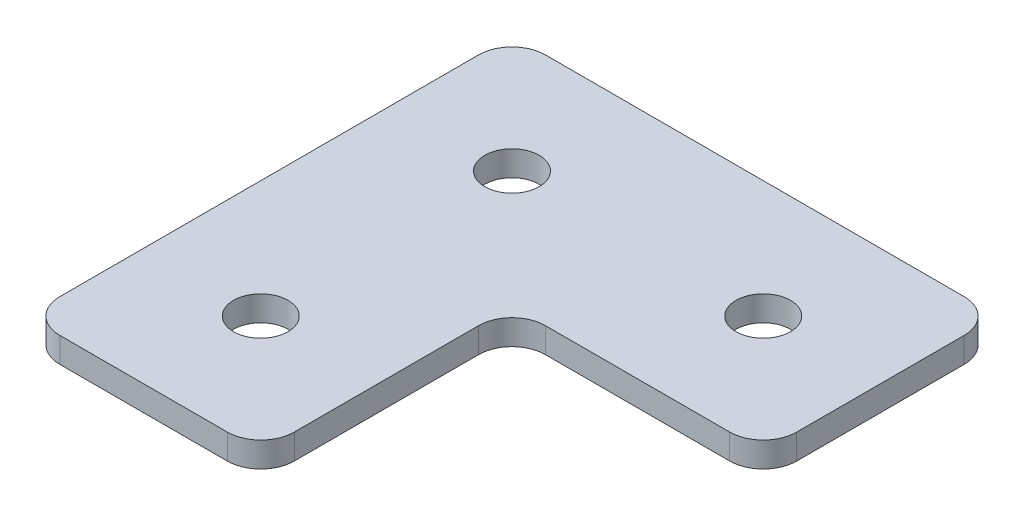
ISO-10303-21;
HEADER;
FILE_DESCRIPTION(('STEP AP214'),'2;1');
FILE_NAME('part.step','',(''),(''),'','','');
FILE_SCHEMA(('AUTOMOTIVE_DESIGN { 1 0 10303 214 1 1 1 1 }'));
ENDSEC;
DATA;
#1=APPLICATION_CONTEXT('core data for automotive mechanical design processes');
#2=APPLICATION_PROTOCOL_DEFINITION('international standard','automotive_design',2000,#1);
#3=PRODUCT_CONTEXT('',#1,'mechanical');
#4=PRODUCT('Part','Part','',(#3));
#5=PRODUCT_RELATED_PRODUCT_CATEGORY('part','',(#4));
#6=PRODUCT_DEFINITION_FORMATION('','',#4);
#7=PRODUCT_DEFINITION_CONTEXT('part definition',#1,'design');
#8=PRODUCT_DEFINITION('design','',#6,#7);
#9=PRODUCT_DEFINITION_SHAPE('','',#8);
#10=(LENGTH_UNIT() NAMED_UNIT(*) SI_UNIT(.MILLI.,.METRE.));
#11=(NAMED_UNIT(*) PLANE_ANGLE_UNIT() SI_UNIT($,.RADIAN.));
#12=(NAMED_UNIT(*) SI_UNIT($,.STERADIAN.) SOLID_ANGLE_UNIT());
#13=UNCERTAINTY_MEASURE_WITH_UNIT(LENGTH_MEASURE(1.E-05),#10,'distance_accuracy_value','');
#14=(GEOMETRIC_REPRESENTATION_CONTEXT(3) GLOBAL_UNCERTAINTY_ASSIGNED_CONTEXT((#13)) GLOBAL_UNIT_ASSIGNED_CONTEXT((#10,
#11,#12)) REPRESENTATION_CONTEXT('',''));
#15=CARTESIAN_POINT('',(0.,0.,0.));
#16=DIRECTION('',(0.,0.,1.));
#17=DIRECTION('',(1.,0.,0.));
#18=AXIS2_PLACEMENT_3D('',#15,#16,#17);
#19=CARTESIAN_POINT('',(-8.76590801914963,1.95798729371791,-8.94163918656655));
#20=DIRECTION('',(0.,-1.,0.));
#21=DIRECTION('',(0.,0.,-1.));
#22=AXIS2_PLACEMENT_3D('',#19,#20,#21);
#23=PLANE('',#22);
#24=CARTESIAN_POINT('',(-8.76590801914964,1.95798729371791,6.05836081343345));
#25=DIRECTION('',(0.,1.,0.));
#26=DIRECTION('',(0.,0.,1.));
#27=AXIS2_PLACEMENT_3D('',#24,#25,#26);
#28=CIRCLE('',#27,1.625);
#29=CARTESIAN_POINT('',(-8.76590801914964,1.95798729371791,7.68336081343345));
#30=VERTEX_POINT('',#29);
#31=EDGE_CURVE('E306',#30,#30,#28,.T.);
#32=ORIENTED_EDGE('',*,*,#31,.T.);
#33=EDGE_LOOP('',(#32));
#34=FACE_BOUND('',#33,.T.);
#35=CARTESIAN_POINT('',(6.23409198085037,1.95798729371791,-8.94163918656654));
#36=DIRECTION('',(0.,1.,0.));
#37=DIRECTION('',(0.,0.,1.));
#38=AXIS2_PLACEMENT_3D('',#35,#36,#37);
#39=CIRCLE('',#38,1.625);
#40=CARTESIAN_POINT('',(6.23409198085037,1.95798729371791,-7.31663918656654));
#41=VERTEX_POINT('',#40);
#42=EDGE_CURVE('E301',#41,#41,#39,.T.);
#43=ORIENTED_EDGE('',*,*,#42,.T.);
#44=EDGE_LOOP('',(#43));
#45=FACE_BOUND('',#44,.T.);
#46=CARTESIAN_POINT('',(-8.76590801914963,1.95798729371791,-8.94163918656655));
#47=DIRECTION('',(0.,1.,0.));
#48=DIRECTION('',(0.,0.,1.));
#49=AXIS2_PLACEMENT_3D('',#46,#47,#48);
#50=CIRCLE('',#49,1.625);
#51=CARTESIAN_POINT('',(-8.76590801914963,1.95798729371791,-7.31663918656655));
#52=VERTEX_POINT('',#51);
#53=EDGE_CURVE('E186',#52,#52,#50,.T.);
#54=ORIENTED_EDGE('',*,*,#53,.T.);
#55=EDGE_LOOP('',(#54));
#56=FACE_BOUND('',#55,.T.);
#57=DIRECTION('',(0.,0.,-1.));
#58=VECTOR('',#57,1.);
#59=CARTESIAN_POINT('',(-1.76590801914953,1.95798729371791,13.0583608134334));
#60=LINE('',#59,#58);
#61=CARTESIAN_POINT('',(-1.76590801914953,1.95798729371791,11.0583608134334));
#62=VERTEX_POINT('',#61);
#63=CARTESIAN_POINT('',(-1.76590801914953,1.95798729371791,0.0583608134334859));
#64=VERTEX_POINT('',#63);
#65=EDGE_CURVE('E132',#62,#64,#60,.T.);
#66=ORIENTED_EDGE('',*,*,#65,.F.);
#67=CARTESIAN_POINT('',(-3.76590801914953,1.95798729371791,11.0583608134334));
#68=DIRECTION('',(0.,-1.,0.));
#69=DIRECTION('',(0.,0.,-1.));
#70=AXIS2_PLACEMENT_3D('',#67,#68,#69);
#71=CIRCLE('',#70,2.);
#72=CARTESIAN_POINT('',(-3.76590801914953,1.95798729371791,13.0583608134334));
#73=VERTEX_POINT('',#72);
#74=EDGE_CURVE('E131',#62,#73,#71,.T.);
#75=ORIENTED_EDGE('',*,*,#74,.T.);
#76=DIRECTION('',(1.,0.,0.));
#77=VECTOR('',#76,1.);
#78=CARTESIAN_POINT('',(-15.7659080191497,1.95798729371791,13.0583608134334));
#79=LINE('',#78,#77);
#80=CARTESIAN_POINT('',(-13.7659080191497,1.95798729371791,13.0583608134334));
#81=VERTEX_POINT('',#80);
#82=EDGE_CURVE('E136',#81,#73,#79,.T.);
#83=ORIENTED_EDGE('',*,*,#82,.F.);
#84=CARTESIAN_POINT('',(-13.7659080191497,1.95798729371791,11.0583608134334));
#85=DIRECTION('',(0.,-1.,0.));
#86=DIRECTION('',(0.,0.,-1.));
#87=AXIS2_PLACEMENT_3D('',#84,#85,#86);
#88=CIRCLE('',#87,2.);
#89=CARTESIAN_POINT('',(-15.7659080191497,1.95798729371791,11.0583608134334));
#90=VERTEX_POINT('',#89);
#91=EDGE_CURVE('E116',#81,#90,#88,.T.);
#92=ORIENTED_EDGE('',*,*,#91,.T.);
#93=DIRECTION('',(0.,0.,1.));
#94=VECTOR('',#93,1.);
#95=CARTESIAN_POINT('',(-15.7659080191497,1.95798729371791,-15.9416391865666));
#96=LINE('',#95,#94);
#97=CARTESIAN_POINT('',(-15.7659080191497,1.95798729371791,-13.9416391865666));
#98=VERTEX_POINT('',#97);
#99=EDGE_CURVE('E202',#98,#90,#96,.T.);
#100=ORIENTED_EDGE('',*,*,#99,.F.);
#101=CARTESIAN_POINT('',(-13.7659080191497,1.95798729371791,-13.9416391865666));
#102=DIRECTION('',(0.,-1.,0.));
#103=DIRECTION('',(0.,0.,-1.));
#104=AXIS2_PLACEMENT_3D('',#101,#102,#103);
#105=CIRCLE('',#104,2.);
#106=CARTESIAN_POINT('',(-13.7659080191497,1.95798729371791,-15.9416391865666));
#107=VERTEX_POINT('',#106);
#108=EDGE_CURVE('E31',#98,#107,#105,.T.);
#109=ORIENTED_EDGE('',*,*,#108,.T.);
#110=DIRECTION('',(-1.,0.,0.));
#111=VECTOR('',#110,1.);
#112=CARTESIAN_POINT('',(13.2340919808503,1.95798729371791,-15.9416391865666));
#113=LINE('',#112,#111);
#114=CARTESIAN_POINT('',(11.2340919808503,1.95798729371791,-15.9416391865666));
#115=VERTEX_POINT('',#114);
#116=EDGE_CURVE('E195',#115,#107,#113,.T.);
#117=ORIENTED_EDGE('',*,*,#116,.F.);
#118=CARTESIAN_POINT('',(11.2340919808503,1.95798729371791,-13.9416391865666));
#119=DIRECTION('',(0.,-1.,0.));
#120=DIRECTION('',(0.,0.,-1.));
#121=AXIS2_PLACEMENT_3D('',#118,#119,#120);
#122=CIRCLE('',#121,2.);
#123=CARTESIAN_POINT('',(13.2340919808503,1.95798729371791,-13.9416391865666));
#124=VERTEX_POINT('',#123);
#125=EDGE_CURVE('E157',#115,#124,#122,.T.);
#126=ORIENTED_EDGE('',*,*,#125,.T.);
#127=DIRECTION('',(0.,0.,-1.));
#128=VECTOR('',#127,1.);
#129=CARTESIAN_POINT('',(13.2340919808503,1.95798729371791,-1.94163918656651));
#130=LINE('',#129,#128);
#131=CARTESIAN_POINT('',(13.2340919808503,1.95798729371791,-3.94163918656652));
#132=VERTEX_POINT('',#131);
#133=EDGE_CURVE('E192',#132,#124,#130,.T.);
#134=ORIENTED_EDGE('',*,*,#133,.F.);
#135=CARTESIAN_POINT('',(11.2340919808503,1.95798729371791,-3.94163918656651));
#136=DIRECTION('',(0.,-1.,0.));
#137=DIRECTION('',(0.,0.,-1.));
#138=AXIS2_PLACEMENT_3D('',#135,#136,#137);
#139=CIRCLE('',#138,2.);
#140=CARTESIAN_POINT('',(11.2340919808503,1.95798729371791,-1.94163918656651));
#141=VERTEX_POINT('',#140);
#142=EDGE_CURVE('E159',#132,#141,#139,.T.);
#143=ORIENTED_EDGE('',*,*,#142,.T.);
#144=DIRECTION('',(1.,0.,0.));
#145=VECTOR('',#144,1.);
#146=CARTESIAN_POINT('',(-1.76590801914953,1.95798729371791,-1.94163918656651));
#147=LINE('',#146,#145);
#148=CARTESIAN_POINT('',(0.234091980850469,1.95798729371791,-1.94163918656651));
#149=VERTEX_POINT('',#148);
#150=EDGE_CURVE('E127',#149,#141,#147,.T.);
#151=ORIENTED_EDGE('',*,*,#150,.F.);
#152=CARTESIAN_POINT('',(0.234091980850469,1.95798729371791,0.0583608134334859));
#153=DIRECTION('',(0.,-1.,0.));
#154=DIRECTION('',(0.,0.,-1.));
#155=AXIS2_PLACEMENT_3D('',#152,#153,#154);
#156=CIRCLE('',#155,2.);
#157=EDGE_CURVE('E10',#149,#64,#156,.F.);
#158=ORIENTED_EDGE('',*,*,#157,.T.);
#159=EDGE_LOOP('',(#66,#75,#83,#92,#100,#109,#117,#126,#134,#143,#151,#158));
#160=FACE_BOUND('',#159,.T.);
#161=ADVANCED_FACE('F16',(#34,#45,#56,#160),#23,.T.);
#162=CARTESIAN_POINT('',(-1.76590801914953,1.95798729371791,-1.94163918656651));
#163=DIRECTION('',(0.,0.,1.));
#164=DIRECTION('',(1.,0.,0.));
#165=AXIS2_PLACEMENT_3D('',#162,#163,#164);
#166=PLANE('',#165);
#167=DIRECTION('',(1.,0.,0.));
#168=VECTOR('',#167,1.);
#169=CARTESIAN_POINT('',(-1.76590801914953,3.45798729371791,-1.94163918656651));
#170=LINE('',#169,#168);
#171=CARTESIAN_POINT('',(0.234091980850469,3.45798729371791,-1.94163918656651));
#172=VERTEX_POINT('',#171);
#173=CARTESIAN_POINT('',(11.2340919808503,3.45798729371791,-1.94163918656651));
#174=VERTEX_POINT('',#173);
#175=EDGE_CURVE('E177',#172,#174,#170,.T.);
#176=ORIENTED_EDGE('',*,*,#175,.F.);
#177=DIRECTION('',(0.,1.,0.));
#178=VECTOR('',#177,1.);
#179=CARTESIAN_POINT('',(0.234091980850469,1.95798729371791,-1.94163918656651));
#180=LINE('',#179,#178);
#181=EDGE_CURVE('E142',#172,#149,#180,.F.);
#182=ORIENTED_EDGE('',*,*,#181,.T.);
#183=ORIENTED_EDGE('',*,*,#150,.T.);
#184=DIRECTION('',(0.,1.,0.));
#185=VECTOR('',#184,1.);
#186=CARTESIAN_POINT('',(11.2340919808503,1.95798729371791,-1.94163918656651));
#187=LINE('',#186,#185);
#188=EDGE_CURVE('E134',#141,#174,#187,.T.);
#189=ORIENTED_EDGE('',*,*,#188,.T.);
#190=EDGE_LOOP('',(#176,#182,#183,#189));
#191=FACE_BOUND('',#190,.T.);
#192=ADVANCED_FACE('F181',(#191),#166,.T.);
#193=CARTESIAN_POINT('',(-1.76590801914953,1.95798729371791,13.0583608134334));
#194=DIRECTION('',(1.,0.,0.));
#195=DIRECTION('',(0.,0.,-1.));
#196=AXIS2_PLACEMENT_3D('',#193,#194,#195);
#197=PLANE('',#196);
#198=ORIENTED_EDGE('',*,*,#65,.T.);
#199=DIRECTION('',(0.,1.,0.));
#200=VECTOR('',#199,1.);
#201=CARTESIAN_POINT('',(-1.76590801914953,3.45798729371791,0.0583608134334859));
#202=LINE('',#201,#200);
#203=CARTESIAN_POINT('',(-1.76590801914953,3.45798729371791,0.0583608134334859));
#204=VERTEX_POINT('',#203);
#205=EDGE_CURVE('E126',#64,#204,#202,.T.);
#206=ORIENTED_EDGE('',*,*,#205,.T.);
#207=DIRECTION('',(0.,0.,-1.));
#208=VECTOR('',#207,1.);
#209=CARTESIAN_POINT('',(-1.76590801914953,3.45798729371791,13.0583608134334));
#210=LINE('',#209,#208);
#211=CARTESIAN_POINT('',(-1.76590801914953,3.45798729371791,11.0583608134334));
#212=VERTEX_POINT('',#211);
#213=EDGE_CURVE('E109',#212,#204,#210,.T.);
#214=ORIENTED_EDGE('',*,*,#213,.F.);
#215=DIRECTION('',(0.,1.,0.));
#216=VECTOR('',#215,1.);
#217=CARTESIAN_POINT('',(-1.76590801914953,1.95798729371791,11.0583608134334));
#218=LINE('',#217,#216);
#219=EDGE_CURVE('E123',#212,#62,#218,.F.);
#220=ORIENTED_EDGE('',*,*,#219,.T.);
#221=EDGE_LOOP('',(#198,#206,#214,#220));
#222=FACE_BOUND('',#221,.T.);
#223=ADVANCED_FACE('F122',(#222),#197,.T.);
#224=CARTESIAN_POINT('',(-15.7659080191497,1.95798729371791,13.0583608134334));
#225=DIRECTION('',(0.,0.,1.));
#226=DIRECTION('',(1.,0.,0.));
#227=AXIS2_PLACEMENT_3D('',#224,#225,#226);
#228=PLANE('',#227);
#229=ORIENTED_EDGE('',*,*,#82,.T.);
#230=DIRECTION('',(0.,1.,0.));
#231=VECTOR('',#230,1.);
#232=CARTESIAN_POINT('',(-3.76590801914953,1.95798729371791,13.0583608134334));
#233=LINE('',#232,#231);
#234=CARTESIAN_POINT('',(-3.76590801914953,3.45798729371791,13.0583608134334));
#235=VERTEX_POINT('',#234);
#236=EDGE_CURVE('E146',#73,#235,#233,.T.);
#237=ORIENTED_EDGE('',*,*,#236,.T.);
#238=DIRECTION('',(1.,0.,0.));
#239=VECTOR('',#238,1.);
#240=CARTESIAN_POINT('',(-15.7659080191497,3.45798729371791,13.0583608134334));
#241=LINE('',#240,#239);
#242=CARTESIAN_POINT('',(-13.7659080191497,3.45798729371791,13.0583608134334));
#243=VERTEX_POINT('',#242);
#244=EDGE_CURVE('E111',#243,#235,#241,.T.);
#245=ORIENTED_EDGE('',*,*,#244,.F.);
#246=DIRECTION('',(0.,1.,0.));
#247=VECTOR('',#246,1.);
#248=CARTESIAN_POINT('',(-13.7659080191497,1.95798729371791,13.0583608134334));
#249=LINE('',#248,#247);
#250=EDGE_CURVE('E144',#243,#81,#249,.F.);
#251=ORIENTED_EDGE('',*,*,#250,.T.);
#252=EDGE_LOOP('',(#229,#237,#245,#251));
#253=FACE_BOUND('',#252,.T.);
#254=ADVANCED_FACE('F275',(#253),#228,.T.);
#255=CARTESIAN_POINT('',(-15.7659080191497,1.95798729371791,-15.9416391865666));
#256=DIRECTION('',(-1.,0.,0.));
#257=DIRECTION('',(0.,0.,1.));
#258=AXIS2_PLACEMENT_3D('',#255,#256,#257);
#259=PLANE('',#258);
#260=DIRECTION('',(0.,0.,1.));
#261=VECTOR('',#260,1.);
#262=CARTESIAN_POINT('',(-15.7659080191497,3.45798729371791,-15.9416391865666));
#263=LINE('',#262,#261);
#264=CARTESIAN_POINT('',(-15.7659080191497,3.45798729371791,-13.9416391865666));
#265=VERTEX_POINT('',#264);
#266=CARTESIAN_POINT('',(-15.7659080191497,3.45798729371791,11.0583608134334));
#267=VERTEX_POINT('',#266);
#268=EDGE_CURVE('E212',#265,#267,#263,.T.);
#269=ORIENTED_EDGE('',*,*,#268,.F.);
#270=DIRECTION('',(0.,1.,0.));
#271=VECTOR('',#270,1.);
#272=CARTESIAN_POINT('',(-15.7659080191497,1.95798729371791,-13.9416391865666));
#273=LINE('',#272,#271);
#274=EDGE_CURVE('E174',#265,#98,#273,.F.);
#275=ORIENTED_EDGE('',*,*,#274,.T.);
#276=ORIENTED_EDGE('',*,*,#99,.T.);
#277=DIRECTION('',(0.,1.,0.));
#278=VECTOR('',#277,1.);
#279=CARTESIAN_POINT('',(-15.7659080191497,1.95798729371791,11.0583608134334));
#280=LINE('',#279,#278);
#281=EDGE_CURVE('E171',#90,#267,#280,.T.);
#282=ORIENTED_EDGE('',*,*,#281,.T.);
#283=EDGE_LOOP('',(#269,#275,#276,#282));
#284=FACE_BOUND('',#283,.T.);
#285=ADVANCED_FACE('F217',(#284),#259,.T.);
#286=CARTESIAN_POINT('',(13.2340919808503,1.95798729371791,-15.9416391865666));
#287=DIRECTION('',(0.,0.,-1.));
#288=DIRECTION('',(-1.,0.,0.));
#289=AXIS2_PLACEMENT_3D('',#286,#287,#288);
#290=PLANE('',#289);
#291=DIRECTION('',(-1.,0.,0.));
#292=VECTOR('',#291,1.);
#293=CARTESIAN_POINT('',(13.2340919808503,3.45798729371791,-15.9416391865666));
#294=LINE('',#293,#292);
#295=CARTESIAN_POINT('',(11.2340919808503,3.45798729371791,-15.9416391865666));
#296=VERTEX_POINT('',#295);
#297=CARTESIAN_POINT('',(-13.7659080191497,3.45798729371791,-15.9416391865666));
#298=VERTEX_POINT('',#297);
#299=EDGE_CURVE('E209',#296,#298,#294,.T.);
#300=ORIENTED_EDGE('',*,*,#299,.F.);
#301=DIRECTION('',(0.,1.,0.));
#302=VECTOR('',#301,1.);
#303=CARTESIAN_POINT('',(11.2340919808503,1.95798729371791,-15.9416391865666));
#304=LINE('',#303,#302);
#305=EDGE_CURVE('E38',#296,#115,#304,.F.);
#306=ORIENTED_EDGE('',*,*,#305,.T.);
#307=ORIENTED_EDGE('',*,*,#116,.T.);
#308=DIRECTION('',(0.,1.,0.));
#309=VECTOR('',#308,1.);
#310=CARTESIAN_POINT('',(-13.7659080191497,1.95798729371791,-15.9416391865666));
#311=LINE('',#310,#309);
#312=EDGE_CURVE('E167',#107,#298,#311,.T.);
#313=ORIENTED_EDGE('',*,*,#312,.T.);
#314=EDGE_LOOP('',(#300,#306,#307,#313));
#315=FACE_BOUND('',#314,.T.);
#316=ADVANCED_FACE('F222',(#315),#290,.T.);
#317=CARTESIAN_POINT('',(13.2340919808503,1.95798729371791,-1.94163918656651));
#318=DIRECTION('',(1.,0.,0.));
#319=DIRECTION('',(0.,0.,-1.));
#320=AXIS2_PLACEMENT_3D('',#317,#318,#319);
#321=PLANE('',#320);
#322=DIRECTION('',(0.,0.,-1.));
#323=VECTOR('',#322,1.);
#324=CARTESIAN_POINT('',(13.2340919808503,3.45798729371791,-1.94163918656651));
#325=LINE('',#324,#323);
#326=CARTESIAN_POINT('',(13.2340919808503,3.45798729371791,-3.94163918656652));
#327=VERTEX_POINT('',#326);
#328=CARTESIAN_POINT('',(13.2340919808503,3.45798729371791,-13.9416391865666));
#329=VERTEX_POINT('',#328);
#330=EDGE_CURVE('E185',#327,#329,#325,.T.);
#331=ORIENTED_EDGE('',*,*,#330,.F.);
#332=DIRECTION('',(0.,1.,0.));
#333=VECTOR('',#332,1.);
#334=CARTESIAN_POINT('',(13.2340919808503,1.95798729371791,-3.94163918656652));
#335=LINE('',#334,#333);
#336=EDGE_CURVE('E165',#327,#132,#335,.F.);
#337=ORIENTED_EDGE('',*,*,#336,.T.);
#338=ORIENTED_EDGE('',*,*,#133,.T.);
#339=DIRECTION('',(0.,1.,0.));
#340=VECTOR('',#339,1.);
#341=CARTESIAN_POINT('',(13.2340919808503,1.95798729371791,-13.9416391865666));
#342=LINE('',#341,#340);
#343=EDGE_CURVE('E162',#124,#329,#342,.T.);
#344=ORIENTED_EDGE('',*,*,#343,.T.);
#345=EDGE_LOOP('',(#331,#337,#338,#344));
#346=FACE_BOUND('',#345,.T.);
#347=ADVANCED_FACE('F229',(#346),#321,.T.);
#348=CARTESIAN_POINT('',(-8.76590801914963,3.45798729371791,-8.94163918656655));
#349=DIRECTION('',(0.,-1.,0.));
#350=DIRECTION('',(0.,0.,-1.));
#351=AXIS2_PLACEMENT_3D('',#348,#349,#350);
#352=PLANE('',#351);
#353=CARTESIAN_POINT('',(-8.76590801914964,3.45798729371791,6.05836081343345));
#354=DIRECTION('',(0.,1.,0.));
#355=DIRECTION('',(0.,0.,1.));
#356=AXIS2_PLACEMENT_3D('',#353,#354,#355);
#357=CIRCLE('',#356,1.625);
#358=CARTESIAN_POINT('',(-8.76590801914964,3.45798729371791,7.68336081343345));
#359=VERTEX_POINT('',#358);
#360=EDGE_CURVE('E293',#359,#359,#357,.T.);
#361=ORIENTED_EDGE('',*,*,#360,.F.);
#362=EDGE_LOOP('',(#361));
#363=FACE_BOUND('',#362,.T.);
#364=CARTESIAN_POINT('',(6.23409198085037,3.45798729371791,-8.94163918656654));
#365=DIRECTION('',(0.,1.,0.));
#366=DIRECTION('',(0.,0.,1.));
#367=AXIS2_PLACEMENT_3D('',#364,#365,#366);
#368=CIRCLE('',#367,1.625);
#369=CARTESIAN_POINT('',(6.23409198085037,3.45798729371791,-7.31663918656654));
#370=VERTEX_POINT('',#369);
#371=EDGE_CURVE('E297',#370,#370,#368,.T.);
#372=ORIENTED_EDGE('',*,*,#371,.F.);
#373=EDGE_LOOP('',(#372));
#374=FACE_BOUND('',#373,.T.);
#375=CARTESIAN_POINT('',(-8.76590801914963,3.45798729371791,-8.94163918656655));
#376=DIRECTION('',(0.,1.,0.));
#377=DIRECTION('',(0.,0.,1.));
#378=AXIS2_PLACEMENT_3D('',#375,#376,#377);
#379=CIRCLE('',#378,1.625);
#380=CARTESIAN_POINT('',(-8.76590801914963,3.45798729371791,-7.31663918656655));
#381=VERTEX_POINT('',#380);
#382=EDGE_CURVE('E198',#381,#381,#379,.T.);
#383=ORIENTED_EDGE('',*,*,#382,.F.);
#384=EDGE_LOOP('',(#383));
#385=FACE_BOUND('',#384,.T.);
#386=ORIENTED_EDGE('',*,*,#244,.T.);
#387=CARTESIAN_POINT('',(-3.76590801914953,3.45798729371791,11.0583608134334));
#388=DIRECTION('',(0.,-1.,0.));
#389=DIRECTION('',(0.,0.,-1.));
#390=AXIS2_PLACEMENT_3D('',#387,#388,#389);
#391=CIRCLE('',#390,2.);
#392=EDGE_CURVE('E106',#235,#212,#391,.F.);
#393=ORIENTED_EDGE('',*,*,#392,.T.);
#394=ORIENTED_EDGE('',*,*,#213,.T.);
#395=CARTESIAN_POINT('',(0.234091980850469,3.45798729371791,0.0583608134334859));
#396=DIRECTION('',(0.,-1.,0.));
#397=DIRECTION('',(0.,0.,-1.));
#398=AXIS2_PLACEMENT_3D('',#395,#396,#397);
#399=CIRCLE('',#398,2.);
#400=EDGE_CURVE('E24',#204,#172,#399,.T.);
#401=ORIENTED_EDGE('',*,*,#400,.T.);
#402=ORIENTED_EDGE('',*,*,#175,.T.);
#403=CARTESIAN_POINT('',(11.2340919808503,3.45798729371791,-3.94163918656651));
#404=DIRECTION('',(0.,-1.,0.));
#405=DIRECTION('',(0.,0.,-1.));
#406=AXIS2_PLACEMENT_3D('',#403,#404,#405);
#407=CIRCLE('',#406,2.);
#408=EDGE_CURVE('E117',#174,#327,#407,.F.);
#409=ORIENTED_EDGE('',*,*,#408,.T.);
#410=ORIENTED_EDGE('',*,*,#330,.T.);
#411=CARTESIAN_POINT('',(11.2340919808503,3.45798729371791,-13.9416391865666));
#412=DIRECTION('',(0.,-1.,0.));
#413=DIRECTION('',(0.,0.,-1.));
#414=AXIS2_PLACEMENT_3D('',#411,#412,#413);
#415=CIRCLE('',#414,2.);
#416=EDGE_CURVE('E152',#329,#296,#415,.F.);
#417=ORIENTED_EDGE('',*,*,#416,.T.);
#418=ORIENTED_EDGE('',*,*,#299,.T.);
#419=CARTESIAN_POINT('',(-13.7659080191497,3.45798729371791,-13.9416391865666));
#420=DIRECTION('',(0.,-1.,0.));
#421=DIRECTION('',(0.,0.,-1.));
#422=AXIS2_PLACEMENT_3D('',#419,#420,#421);
#423=CIRCLE('',#422,2.);
#424=EDGE_CURVE('E150',#298,#265,#423,.F.);
#425=ORIENTED_EDGE('',*,*,#424,.T.);
#426=ORIENTED_EDGE('',*,*,#268,.T.);
#427=CARTESIAN_POINT('',(-13.7659080191497,3.45798729371791,11.0583608134334));
#428=DIRECTION('',(0.,-1.,0.));
#429=DIRECTION('',(0.,0.,-1.));
#430=AXIS2_PLACEMENT_3D('',#427,#428,#429);
#431=CIRCLE('',#430,2.);
#432=EDGE_CURVE('E148',#267,#243,#431,.F.);
#433=ORIENTED_EDGE('',*,*,#432,.T.);
#434=EDGE_LOOP('',(#386,#393,#394,#401,#402,#409,#410,#417,#418,#425,#426,#433));
#435=FACE_BOUND('',#434,.T.);
#436=ADVANCED_FACE('F108',(#363,#374,#385,#435),#352,.F.);
#437=CARTESIAN_POINT('',(-8.76590801914963,1.95798729371791,-8.94163918656655));
#438=DIRECTION('',(0.,1.,0.));
#439=DIRECTION('',(0.,0.,1.));
#440=AXIS2_PLACEMENT_3D('',#437,#438,#439);
#441=CYLINDRICAL_SURFACE('',#440,1.625);
#442=ORIENTED_EDGE('',*,*,#53,.F.);
#443=EDGE_LOOP('',(#442));
#444=FACE_BOUND('',#443,.T.);
#445=ORIENTED_EDGE('',*,*,#382,.T.);
#446=EDGE_LOOP('',(#445));
#447=FACE_BOUND('',#446,.T.);
#448=ADVANCED_FACE('F264',(#444,#447),#441,.F.);
#449=CARTESIAN_POINT('',(6.23409198085037,1.95798729371791,-8.94163918656654));
#450=DIRECTION('',(0.,1.,0.));
#451=DIRECTION('',(0.,0.,1.));
#452=AXIS2_PLACEMENT_3D('',#449,#450,#451);
#453=CYLINDRICAL_SURFACE('',#452,1.625);
#454=ORIENTED_EDGE('',*,*,#42,.F.);
#455=EDGE_LOOP('',(#454));
#456=FACE_BOUND('',#455,.T.);
#457=ORIENTED_EDGE('',*,*,#371,.T.);
#458=EDGE_LOOP('',(#457));
#459=FACE_BOUND('',#458,.T.);
#460=ADVANCED_FACE('F258',(#456,#459),#453,.F.);
#461=CARTESIAN_POINT('',(-8.76590801914964,1.95798729371791,6.05836081343345));
#462=DIRECTION('',(0.,1.,0.));
#463=DIRECTION('',(0.,0.,1.));
#464=AXIS2_PLACEMENT_3D('',#461,#462,#463);
#465=CYLINDRICAL_SURFACE('',#464,1.625);
#466=ORIENTED_EDGE('',*,*,#31,.F.);
#467=EDGE_LOOP('',(#466));
#468=FACE_BOUND('',#467,.T.);
#469=ORIENTED_EDGE('',*,*,#360,.T.);
#470=EDGE_LOOP('',(#469));
#471=FACE_BOUND('',#470,.T.);
#472=ADVANCED_FACE('F254',(#468,#471),#465,.F.);
#473=CARTESIAN_POINT('',(0.234091980850469,1.95798729371791,0.0583608134334859));
#474=DIRECTION('',(0.,-1.,0.));
#475=DIRECTION('',(0.,0.,-1.));
#476=AXIS2_PLACEMENT_3D('',#473,#474,#475);
#477=CYLINDRICAL_SURFACE('',#476,2.);
#478=ORIENTED_EDGE('',*,*,#157,.F.);
#479=ORIENTED_EDGE('',*,*,#181,.F.);
#480=ORIENTED_EDGE('',*,*,#400,.F.);
#481=ORIENTED_EDGE('',*,*,#205,.F.);
#482=EDGE_LOOP('',(#478,#479,#480,#481));
#483=FACE_BOUND('',#482,.T.);
#484=ADVANCED_FACE('F189',(#483),#477,.F.);
#485=CARTESIAN_POINT('',(-3.76590801914953,1.95798729371791,11.0583608134334));
#486=DIRECTION('',(0.,1.,0.));
#487=DIRECTION('',(0.,0.,1.));
#488=AXIS2_PLACEMENT_3D('',#485,#486,#487);
#489=CYLINDRICAL_SURFACE('',#488,2.);
#490=ORIENTED_EDGE('',*,*,#74,.F.);
#491=ORIENTED_EDGE('',*,*,#219,.F.);
#492=ORIENTED_EDGE('',*,*,#392,.F.);
#493=ORIENTED_EDGE('',*,*,#236,.F.);
#494=EDGE_LOOP('',(#490,#491,#492,#493));
#495=FACE_BOUND('',#494,.T.);
#496=ADVANCED_FACE('F130',(#495),#489,.T.);
#497=CARTESIAN_POINT('',(11.2340919808503,1.95798729371791,-3.94163918656651));
#498=DIRECTION('',(0.,1.,0.));
#499=DIRECTION('',(0.,0.,1.));
#500=AXIS2_PLACEMENT_3D('',#497,#498,#499);
#501=CYLINDRICAL_SURFACE('',#500,2.);
#502=ORIENTED_EDGE('',*,*,#142,.F.);
#503=ORIENTED_EDGE('',*,*,#336,.F.);
#504=ORIENTED_EDGE('',*,*,#408,.F.);
#505=ORIENTED_EDGE('',*,*,#188,.F.);
#506=EDGE_LOOP('',(#502,#503,#504,#505));
#507=FACE_BOUND('',#506,.T.);
#508=ADVANCED_FACE('F232',(#507),#501,.T.);
#509=CARTESIAN_POINT('',(11.2340919808503,1.95798729371791,-13.9416391865666));
#510=DIRECTION('',(0.,1.,0.));
#511=DIRECTION('',(0.,0.,1.));
#512=AXIS2_PLACEMENT_3D('',#509,#510,#511);
#513=CYLINDRICAL_SURFACE('',#512,2.);
#514=ORIENTED_EDGE('',*,*,#125,.F.);
#515=ORIENTED_EDGE('',*,*,#305,.F.);
#516=ORIENTED_EDGE('',*,*,#416,.F.);
#517=ORIENTED_EDGE('',*,*,#343,.F.);
#518=EDGE_LOOP('',(#514,#515,#516,#517));
#519=FACE_BOUND('',#518,.T.);
#520=ADVANCED_FACE('F227',(#519),#513,.T.);
#521=CARTESIAN_POINT('',(-13.7659080191497,1.95798729371791,-13.9416391865666));
#522=DIRECTION('',(0.,1.,0.));
#523=DIRECTION('',(0.,0.,1.));
#524=AXIS2_PLACEMENT_3D('',#521,#522,#523);
#525=CYLINDRICAL_SURFACE('',#524,2.);
#526=ORIENTED_EDGE('',*,*,#108,.F.);
#527=ORIENTED_EDGE('',*,*,#274,.F.);
#528=ORIENTED_EDGE('',*,*,#424,.F.);
#529=ORIENTED_EDGE('',*,*,#312,.F.);
#530=EDGE_LOOP('',(#526,#527,#528,#529));
#531=FACE_BOUND('',#530,.T.);
#532=ADVANCED_FACE('F220',(#531),#525,.T.);
#533=CARTESIAN_POINT('',(-13.7659080191497,1.95798729371791,11.0583608134334));
#534=DIRECTION('',(0.,1.,0.));
#535=DIRECTION('',(0.,0.,1.));
#536=AXIS2_PLACEMENT_3D('',#533,#534,#535);
#537=CYLINDRICAL_SURFACE('',#536,2.);
#538=ORIENTED_EDGE('',*,*,#91,.F.);
#539=ORIENTED_EDGE('',*,*,#250,.F.);
#540=ORIENTED_EDGE('',*,*,#432,.F.);
#541=ORIENTED_EDGE('',*,*,#281,.F.);
#542=EDGE_LOOP('',(#538,#539,#540,#541));
#543=FACE_BOUND('',#542,.T.);
#544=ADVANCED_FACE('F18',(#543),#537,.T.);
#545=CLOSED_SHELL('',(#161,#192,#223,#254,#285,#316,#347,#436,#448,#460,#472,#484,#496,#508,
#520,#532,#544));
#546=MANIFOLD_SOLID_BREP('B1',#545);
#547=ADVANCED_BREP_SHAPE_REPRESENTATION('',(#18,#546),#14);
#548=SHAPE_DEFINITION_REPRESENTATION(#9,#547);
ENDSEC;
END-ISO-10303-21;
